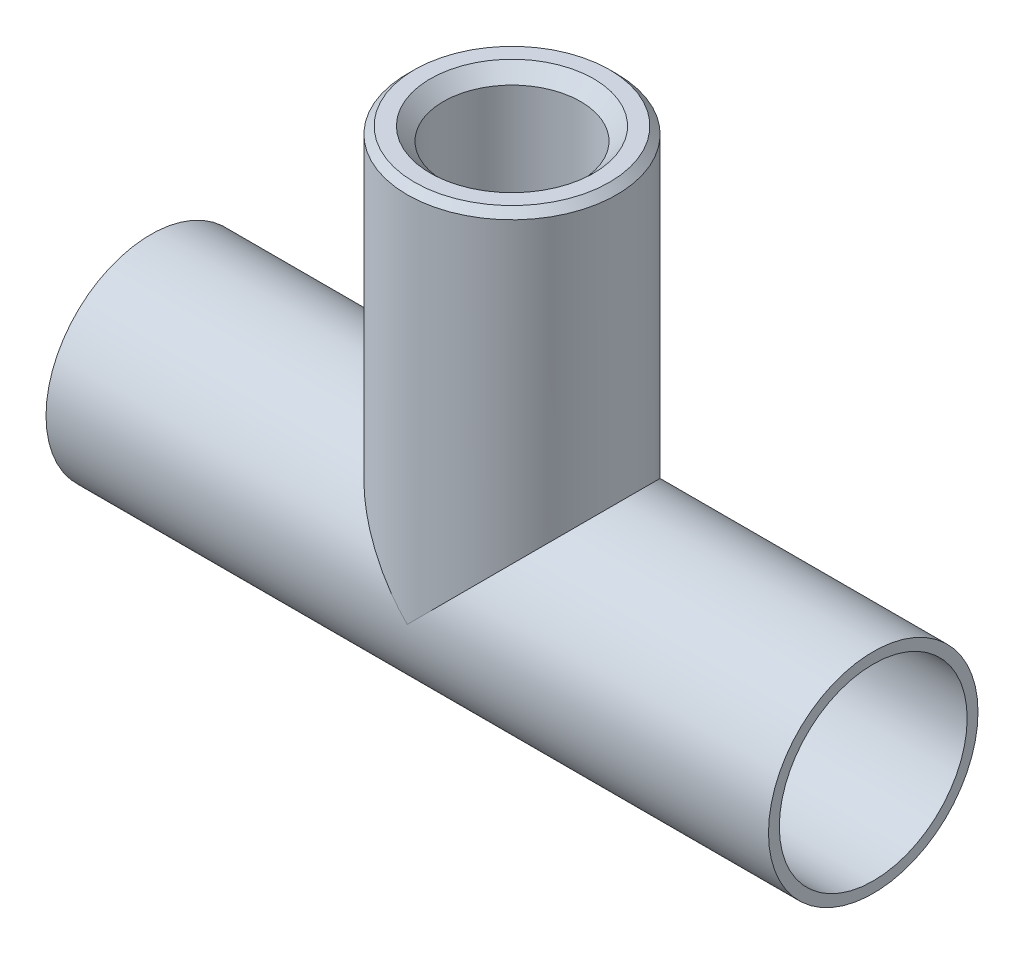
ISO-10303-21;
HEADER;
FILE_DESCRIPTION(('STEP AP214'),'2;1');
FILE_NAME('part.step','',(''),(''),'','','');
FILE_SCHEMA(('AUTOMOTIVE_DESIGN { 1 0 10303 214 1 1 1 1 }'));
ENDSEC;
DATA;
#1=APPLICATION_CONTEXT('core data for automotive mechanical design processes');
#2=APPLICATION_PROTOCOL_DEFINITION('international standard','automotive_design',2000,#1);
#3=PRODUCT_CONTEXT('',#1,'mechanical');
#4=PRODUCT('Part','Part','',(#3));
#5=PRODUCT_RELATED_PRODUCT_CATEGORY('part','',(#4));
#6=PRODUCT_DEFINITION_FORMATION('','',#4);
#7=PRODUCT_DEFINITION_CONTEXT('part definition',#1,'design');
#8=PRODUCT_DEFINITION('design','',#6,#7);
#9=PRODUCT_DEFINITION_SHAPE('','',#8);
#10=(LENGTH_UNIT() NAMED_UNIT(*) SI_UNIT(.MILLI.,.METRE.));
#11=(NAMED_UNIT(*) PLANE_ANGLE_UNIT() SI_UNIT($,.RADIAN.));
#12=(NAMED_UNIT(*) SI_UNIT($,.STERADIAN.) SOLID_ANGLE_UNIT());
#13=UNCERTAINTY_MEASURE_WITH_UNIT(LENGTH_MEASURE(1.E-05),#10,'distance_accuracy_value','');
#14=(GEOMETRIC_REPRESENTATION_CONTEXT(3) GLOBAL_UNCERTAINTY_ASSIGNED_CONTEXT((#13)) GLOBAL_UNIT_ASSIGNED_CONTEXT((#10,
#11,#12)) REPRESENTATION_CONTEXT('',''));
#15=CARTESIAN_POINT('',(0.,0.,0.));
#16=DIRECTION('',(0.,0.,1.));
#17=DIRECTION('',(1.,0.,0.));
#18=AXIS2_PLACEMENT_3D('',#15,#16,#17);
#19=CARTESIAN_POINT('',(0.,27.3542337649345,3.6421451335633E-07));
#20=DIRECTION('',(0.,1.,0.));
#21=DIRECTION('',(0.,0.,-1.));
#22=AXIS2_PLACEMENT_3D('',#19,#20,#21);
#23=CYLINDRICAL_SURFACE('',#22,8.53466386554622);
#24=CARTESIAN_POINT('',(0.,6.017574101069,3.6421451335633E-07));
#25=DIRECTION('',(-0.707106781186548,0.707106781186548,0.));
#26=DIRECTION('',(0.707106781186548,0.707106781186548,0.));
#27=AXIS2_PLACEMENT_3D('',#24,#25,#26);
#28=ELLIPSE('',#27,12.0698373889837,8.53466386554622);
#29=CARTESIAN_POINT('',(0.,6.017574101069,8.53466422976073));
#30=VERTEX_POINT('',#29);
#31=CARTESIAN_POINT('',(0.,6.017574101069,-8.5346635013317));
#32=VERTEX_POINT('',#31);
#33=EDGE_CURVE('E80',#30,#32,#28,.T.);
#34=ORIENTED_EDGE('',*,*,#33,.F.);
#35=CARTESIAN_POINT('',(0.,6.017574101069,3.6421451335633E-07));
#36=DIRECTION('',(0.707106781186548,0.707106781186548,0.));
#37=DIRECTION('',(0.707106781186548,-0.707106781186548,0.));
#38=AXIS2_PLACEMENT_3D('',#35,#36,#37);
#39=ELLIPSE('',#38,12.0698373889837,8.53466386554622);
#40=EDGE_CURVE('E88',#32,#30,#39,.T.);
#41=ORIENTED_EDGE('',*,*,#40,.F.);
#42=EDGE_LOOP('',(#34,#41));
#43=FACE_BOUND('',#42,.T.);
#44=CARTESIAN_POINT('',(0.,16.0622169582119,3.6421451335633E-07));
#45=DIRECTION('',(0.,-1.,0.));
#46=DIRECTION('',(0.,0.,-1.));
#47=AXIS2_PLACEMENT_3D('',#44,#45,#46);
#48=CIRCLE('',#47,8.53466386554622);
#49=CARTESIAN_POINT('',(0.,16.0622169582119,-8.5346635013317));
#50=VERTEX_POINT('',#49);
#51=EDGE_CURVE('E11',#50,#50,#48,.T.);
#52=ORIENTED_EDGE('',*,*,#51,.F.);
#53=EDGE_LOOP('',(#52));
#54=FACE_BOUND('',#53,.T.);
#55=ADVANCED_FACE('F38',(#43,#54),#23,.F.);
#56=CARTESIAN_POINT('',(0.,16.0622169582119,3.6421451335633E-07));
#57=DIRECTION('',(0.,-1.,0.));
#58=DIRECTION('',(0.,0.,-1.));
#59=AXIS2_PLACEMENT_3D('',#56,#57,#58);
#60=TOROIDAL_SURFACE('',#59,6.43382352941176,2.10084033613445);
#61=CARTESIAN_POINT('',(0.,18.1630572943463,3.6421451335633E-07));
#62=DIRECTION('',(0.,-1.,0.));
#63=DIRECTION('',(0.,0.,-1.));
#64=AXIS2_PLACEMENT_3D('',#61,#62,#63);
#65=CIRCLE('',#64,6.43382352941176);
#66=CARTESIAN_POINT('',(0.,18.1630572943463,-6.43382316519725));
#67=VERTEX_POINT('',#66);
#68=EDGE_CURVE('E48',#67,#67,#65,.T.);
#69=ORIENTED_EDGE('',*,*,#68,.F.);
#70=EDGE_LOOP('',(#69));
#71=FACE_BOUND('',#70,.T.);
#72=ORIENTED_EDGE('',*,*,#51,.T.);
#73=EDGE_LOOP('',(#72));
#74=FACE_BOUND('',#73,.T.);
#75=ADVANCED_FACE('F127',(#71,#74),#60,.F.);
#76=CARTESIAN_POINT('',(5.97254558896609,18.1630572943463,3.6421451335633E-07));
#77=DIRECTION('',(0.,-1.,0.));
#78=DIRECTION('',(0.,0.,-1.));
#79=AXIS2_PLACEMENT_3D('',#76,#77,#78);
#80=PLANE('',#79);
#81=CARTESIAN_POINT('',(0.,18.1630572943463,3.6421451335633E-07));
#82=DIRECTION('',(0.,-1.,0.));
#83=DIRECTION('',(0.,0.,-1.));
#84=AXIS2_PLACEMENT_3D('',#81,#82,#83);
#85=CIRCLE('',#84,5.97254558895746);
#86=CARTESIAN_POINT('',(0.,18.1630572943463,-5.97254522475157));
#87=VERTEX_POINT('',#86);
#88=EDGE_CURVE('E64',#87,#87,#85,.T.);
#89=ORIENTED_EDGE('',*,*,#88,.F.);
#90=EDGE_LOOP('',(#89));
#91=FACE_BOUND('',#90,.T.);
#92=ORIENTED_EDGE('',*,*,#68,.T.);
#93=EDGE_LOOP('',(#92));
#94=FACE_BOUND('',#93,.T.);
#95=ADVANCED_FACE('F122',(#91,#94),#80,.T.);
#96=CARTESIAN_POINT('',(0.,18.4256623363631,3.6421451335633E-07));
#97=DIRECTION('',(0.,-1.,0.));
#98=DIRECTION('',(0.,0.,-1.));
#99=AXIS2_PLACEMENT_3D('',#96,#97,#98);
#100=CONICAL_SURFACE('',#99,5.25104416576943,1.2217304764);
#101=CARTESIAN_POINT('',(0.,18.4256623363631,3.6421451335633E-07));
#102=DIRECTION('',(0.,-1.,0.));
#103=DIRECTION('',(0.,0.,-1.));
#104=AXIS2_PLACEMENT_3D('',#101,#102,#103);
#105=CIRCLE('',#104,5.25104416576943);
#106=CARTESIAN_POINT('',(0.,18.4256623363631,-5.25104380157546));
#107=VERTEX_POINT('',#106);
#108=EDGE_CURVE('E67',#107,#107,#105,.T.);
#109=ORIENTED_EDGE('',*,*,#108,.F.);
#110=EDGE_LOOP('',(#109));
#111=FACE_BOUND('',#110,.T.);
#112=ORIENTED_EDGE('',*,*,#88,.T.);
#113=EDGE_LOOP('',(#112));
#114=FACE_BOUND('',#113,.T.);
#115=ADVANCED_FACE('F65',(#111,#114),#100,.F.);
#116=CARTESIAN_POINT('',(0.,19.2528682187161,3.6421451335633E-07));
#117=DIRECTION('',(0.,1.,0.));
#118=DIRECTION('',(0.,0.,1.));
#119=AXIS2_PLACEMENT_3D('',#116,#117,#118);
#120=CONICAL_SURFACE('',#119,6.23686974789916,0.872664626);
#121=ORIENTED_EDGE('',*,*,#108,.T.);
#122=EDGE_LOOP('',(#121));
#123=FACE_BOUND('',#122,.T.);
#124=CARTESIAN_POINT('',(0.,19.2528682187161,3.6421451335633E-07));
#125=DIRECTION('',(0.,-1.,0.));
#126=DIRECTION('',(0.,0.,-1.));
#127=AXIS2_PLACEMENT_3D('',#124,#125,#126);
#128=CIRCLE('',#127,6.23686974789916);
#129=CARTESIAN_POINT('',(0.,19.2528682187161,-6.23686938368465));
#130=VERTEX_POINT('',#129);
#131=EDGE_CURVE('E70',#130,#130,#128,.T.);
#132=ORIENTED_EDGE('',*,*,#131,.F.);
#133=EDGE_LOOP('',(#132));
#134=FACE_BOUND('',#133,.T.);
#135=ADVANCED_FACE('F112',(#123,#134),#120,.F.);
#136=CARTESIAN_POINT('',(0.,27.3542337649345,3.6421451335633E-07));
#137=DIRECTION('',(0.,1.,0.));
#138=DIRECTION('',(0.,0.,-1.));
#139=AXIS2_PLACEMENT_3D('',#136,#137,#138);
#140=CYLINDRICAL_SURFACE('',#139,6.23686974789916);
#141=ORIENTED_EDGE('',*,*,#131,.T.);
#142=EDGE_LOOP('',(#141));
#143=FACE_BOUND('',#142,.T.);
#144=CARTESIAN_POINT('',(0.,39.2925872313211,3.6421451335633E-07));
#145=DIRECTION('',(0.,-1.,0.));
#146=DIRECTION('',(0.,0.,1.));
#147=AXIS2_PLACEMENT_3D('',#144,#145,#146);
#148=CIRCLE('',#147,6.23686974789916);
#149=CARTESIAN_POINT('',(0.,39.2925872313211,6.23687011211367));
#150=VERTEX_POINT('',#149);
#151=EDGE_CURVE('E93',#150,#150,#148,.T.);
#152=ORIENTED_EDGE('',*,*,#151,.F.);
#153=EDGE_LOOP('',(#152));
#154=FACE_BOUND('',#153,.T.);
#155=ADVANCED_FACE('F108',(#143,#154),#140,.F.);
#156=CARTESIAN_POINT('',(0.,40.4844858657749,3.6421451335633E-07));
#157=DIRECTION('',(0.,-1.,0.));
#158=DIRECTION('',(0.,0.,-1.));
#159=AXIS2_PLACEMENT_3D('',#156,#157,#158);
#160=PLANE('',#159);
#161=CARTESIAN_POINT('',(0.,40.4844858657749,3.6421451335633E-07));
#162=DIRECTION('',(0.,-1.,0.));
#163=DIRECTION('',(0.,0.,-1.));
#164=AXIS2_PLACEMENT_3D('',#161,#162,#163);
#165=CIRCLE('',#164,7.42876838235294);
#166=CARTESIAN_POINT('',(0.,40.4844858657749,-7.42876801813843));
#167=VERTEX_POINT('',#166);
#168=EDGE_CURVE('E92',#167,#167,#165,.T.);
#169=ORIENTED_EDGE('',*,*,#168,.T.);
#170=EDGE_LOOP('',(#169));
#171=FACE_BOUND('',#170,.T.);
#172=CARTESIAN_POINT('',(0.,40.4844858657749,3.6421451335633E-07));
#173=DIRECTION('',(0.,-1.,0.));
#174=DIRECTION('',(0.,0.,-1.));
#175=AXIS2_PLACEMENT_3D('',#172,#173,#174);
#176=CIRCLE('',#175,8.86292016806723);
#177=CARTESIAN_POINT('',(0.,40.4844858657749,-8.86291980385271));
#178=VERTEX_POINT('',#177);
#179=EDGE_CURVE('E73',#178,#178,#176,.T.);
#180=ORIENTED_EDGE('',*,*,#179,.F.);
#181=EDGE_LOOP('',(#180));
#182=FACE_BOUND('',#181,.T.);
#183=ADVANCED_FACE('F120',(#171,#182),#160,.F.);
#184=CARTESIAN_POINT('',(0.,40.4844858657749,3.6421451335633E-07));
#185=DIRECTION('',(0.,-1.,0.));
#186=DIRECTION('',(0.,0.,-1.));
#187=AXIS2_PLACEMENT_3D('',#184,#185,#186);
#188=CONICAL_SURFACE('',#187,8.86292016806723,0.7853981634);
#189=ORIENTED_EDGE('',*,*,#179,.T.);
#190=EDGE_LOOP('',(#189));
#191=FACE_BOUND('',#190,.T.);
#192=CARTESIAN_POINT('',(0.,39.8279732607329,3.6421451335633E-07));
#193=DIRECTION('',(0.,-1.,0.));
#194=DIRECTION('',(0.,0.,-1.));
#195=AXIS2_PLACEMENT_3D('',#192,#193,#194);
#196=CIRCLE('',#195,9.51943277310924);
#197=CARTESIAN_POINT('',(0.,39.8279732607329,-9.51943240889473));
#198=VERTEX_POINT('',#197);
#199=EDGE_CURVE('E76',#198,#198,#196,.T.);
#200=ORIENTED_EDGE('',*,*,#199,.F.);
#201=EDGE_LOOP('',(#200));
#202=FACE_BOUND('',#201,.T.);
#203=ADVANCED_FACE('F140',(#191,#202),#188,.T.);
#204=CARTESIAN_POINT('',(0.,6.017574101069,3.6421451335633E-07));
#205=DIRECTION('',(0.,1.,0.));
#206=DIRECTION('',(0.,0.,-1.));
#207=AXIS2_PLACEMENT_3D('',#204,#205,#206);
#208=CYLINDRICAL_SURFACE('',#207,9.51943277310924);
#209=CARTESIAN_POINT('',(0.,6.017574101069,3.6421451335633E-07));
#210=DIRECTION('',(0.707106781186548,0.707106781186548,0.));
#211=DIRECTION('',(0.707106781186548,-0.707106781186548,0.));
#212=AXIS2_PLACEMENT_3D('',#209,#210,#211);
#213=ELLIPSE('',#212,13.4625109338235,9.51943277310924);
#214=CARTESIAN_POINT('',(0.,6.017574101069,-9.51943240889473));
#215=VERTEX_POINT('',#214);
#216=CARTESIAN_POINT('',(0.,6.017574101069,9.51943313732376));
#217=VERTEX_POINT('',#216);
#218=EDGE_CURVE('E85',#215,#217,#213,.T.);
#219=ORIENTED_EDGE('',*,*,#218,.T.);
#220=CARTESIAN_POINT('',(0.,6.017574101069,3.6421451335633E-07));
#221=DIRECTION('',(-0.707106781186548,0.707106781186548,0.));
#222=DIRECTION('',(0.707106781186548,0.707106781186548,0.));
#223=AXIS2_PLACEMENT_3D('',#220,#221,#222);
#224=ELLIPSE('',#223,13.4625109338235,9.51943277310924);
#225=EDGE_CURVE('E89',#217,#215,#224,.T.);
#226=ORIENTED_EDGE('',*,*,#225,.T.);
#227=EDGE_LOOP('',(#219,#226));
#228=FACE_BOUND('',#227,.T.);
#229=ORIENTED_EDGE('',*,*,#199,.T.);
#230=EDGE_LOOP('',(#229));
#231=FACE_BOUND('',#230,.T.);
#232=ADVANCED_FACE('F143',(#228,#231),#208,.T.);
#233=CARTESIAN_POINT('',(0.,40.4844858657749,3.6421451335633E-07));
#234=DIRECTION('',(0.,1.,0.));
#235=DIRECTION('',(0.,0.,1.));
#236=AXIS2_PLACEMENT_3D('',#233,#234,#235);
#237=CONICAL_SURFACE('',#236,7.42876838235294,0.7853981634);
#238=ORIENTED_EDGE('',*,*,#151,.T.);
#239=EDGE_LOOP('',(#238));
#240=FACE_BOUND('',#239,.T.);
#241=ORIENTED_EDGE('',*,*,#168,.F.);
#242=EDGE_LOOP('',(#241));
#243=FACE_BOUND('',#242,.T.);
#244=ADVANCED_FACE('F138',(#240,#243),#237,.F.);
#245=CARTESIAN_POINT('',(-32.8256302521008,6.017574101069,3.6421451335633E-07));
#246=DIRECTION('',(1.,0.,0.));
#247=DIRECTION('',(0.,1.,0.));
#248=AXIS2_PLACEMENT_3D('',#245,#246,#247);
#249=PLANE('',#248);
#250=CARTESIAN_POINT('',(-32.8256302521008,6.017574101069,3.6421451335633E-07));
#251=DIRECTION('',(-1.,0.,0.));
#252=DIRECTION('',(0.,0.,-1.));
#253=AXIS2_PLACEMENT_3D('',#250,#251,#252);
#254=CIRCLE('',#253,8.53466386554622);
#255=CARTESIAN_POINT('',(-32.8256302521008,6.017574101069,-8.5346635013317));
#256=VERTEX_POINT('',#255);
#257=EDGE_CURVE('E81',#256,#256,#254,.T.);
#258=ORIENTED_EDGE('',*,*,#257,.F.);
#259=EDGE_LOOP('',(#258));
#260=FACE_BOUND('',#259,.T.);
#261=CARTESIAN_POINT('',(-32.8256302521008,6.017574101069,3.6421451335633E-07));
#262=DIRECTION('',(1.,0.,0.));
#263=DIRECTION('',(0.,0.,-1.));
#264=AXIS2_PLACEMENT_3D('',#261,#262,#263);
#265=CIRCLE('',#264,9.51943277310924);
#266=CARTESIAN_POINT('',(-32.8256302521008,6.017574101069,-9.51943240889473));
#267=VERTEX_POINT('',#266);
#268=EDGE_CURVE('E82',#267,#267,#265,.T.);
#269=ORIENTED_EDGE('',*,*,#268,.F.);
#270=EDGE_LOOP('',(#269));
#271=FACE_BOUND('',#270,.T.);
#272=ADVANCED_FACE('F195',(#260,#271),#249,.F.);
#273=CARTESIAN_POINT('',(32.8256302521008,6.017574101069,3.6421451335633E-07));
#274=DIRECTION('',(-1.,0.,0.));
#275=DIRECTION('',(0.,0.,-1.));
#276=AXIS2_PLACEMENT_3D('',#273,#274,#275);
#277=CYLINDRICAL_SURFACE('',#276,9.51943277310924);
#278=ORIENTED_EDGE('',*,*,#218,.F.);
#279=ORIENTED_EDGE('',*,*,#225,.F.);
#280=EDGE_LOOP('',(#278,#279));
#281=FACE_BOUND('',#280,.T.);
#282=CARTESIAN_POINT('',(32.8256302521008,6.017574101069,3.6421451335633E-07));
#283=DIRECTION('',(1.,0.,0.));
#284=DIRECTION('',(0.,0.,-1.));
#285=AXIS2_PLACEMENT_3D('',#282,#283,#284);
#286=CIRCLE('',#285,9.51943277310924);
#287=CARTESIAN_POINT('',(32.8256302521008,6.017574101069,-9.51943240889473));
#288=VERTEX_POINT('',#287);
#289=EDGE_CURVE('E42',#288,#288,#286,.T.);
#290=ORIENTED_EDGE('',*,*,#289,.F.);
#291=EDGE_LOOP('',(#290));
#292=FACE_BOUND('',#291,.T.);
#293=ORIENTED_EDGE('',*,*,#268,.T.);
#294=EDGE_LOOP('',(#293));
#295=FACE_BOUND('',#294,.T.);
#296=ADVANCED_FACE('F40',(#281,#292,#295),#277,.T.);
#297=CARTESIAN_POINT('',(32.8256302521008,15.5370068741782,3.6421451335633E-07));
#298=DIRECTION('',(-1.,0.,0.));
#299=DIRECTION('',(0.,0.,1.));
#300=AXIS2_PLACEMENT_3D('',#297,#298,#299);
#301=PLANE('',#300);
#302=CARTESIAN_POINT('',(32.8256302521008,6.017574101069,3.6421451335633E-07));
#303=DIRECTION('',(1.,0.,0.));
#304=DIRECTION('',(0.,0.,1.));
#305=AXIS2_PLACEMENT_3D('',#302,#303,#304);
#306=CIRCLE('',#305,8.53466386554622);
#307=CARTESIAN_POINT('',(32.8256302521008,6.017574101069,8.53466422976073));
#308=VERTEX_POINT('',#307);
#309=EDGE_CURVE('E77',#308,#308,#306,.T.);
#310=ORIENTED_EDGE('',*,*,#309,.F.);
#311=EDGE_LOOP('',(#310));
#312=FACE_BOUND('',#311,.T.);
#313=ORIENTED_EDGE('',*,*,#289,.T.);
#314=EDGE_LOOP('',(#313));
#315=FACE_BOUND('',#314,.T.);
#316=ADVANCED_FACE('F147',(#312,#315),#301,.F.);
#317=CARTESIAN_POINT('',(36.1081932773109,6.017574101069,3.6421451335633E-07));
#318=DIRECTION('',(-1.,0.,0.));
#319=DIRECTION('',(0.,0.,-1.));
#320=AXIS2_PLACEMENT_3D('',#317,#318,#319);
#321=CYLINDRICAL_SURFACE('',#320,8.53466386554622);
#322=ORIENTED_EDGE('',*,*,#33,.T.);
#323=ORIENTED_EDGE('',*,*,#40,.T.);
#324=EDGE_LOOP('',(#322,#323));
#325=FACE_BOUND('',#324,.T.);
#326=ORIENTED_EDGE('',*,*,#309,.T.);
#327=EDGE_LOOP('',(#326));
#328=FACE_BOUND('',#327,.T.);
#329=ORIENTED_EDGE('',*,*,#257,.T.);
#330=EDGE_LOOP('',(#329));
#331=FACE_BOUND('',#330,.T.);
#332=ADVANCED_FACE('F150',(#325,#328,#331),#321,.F.);
#333=CLOSED_SHELL('',(#55,#75,#95,#115,#135,#155,#183,#203,#232,#244,#272,#296,#316,#332));
#334=MANIFOLD_SOLID_BREP('B2',#333);
#335=ADVANCED_BREP_SHAPE_REPRESENTATION('',(#18,#334),#14);
#336=SHAPE_DEFINITION_REPRESENTATION(#9,#335);
ENDSEC;
END-ISO-10303-21;
